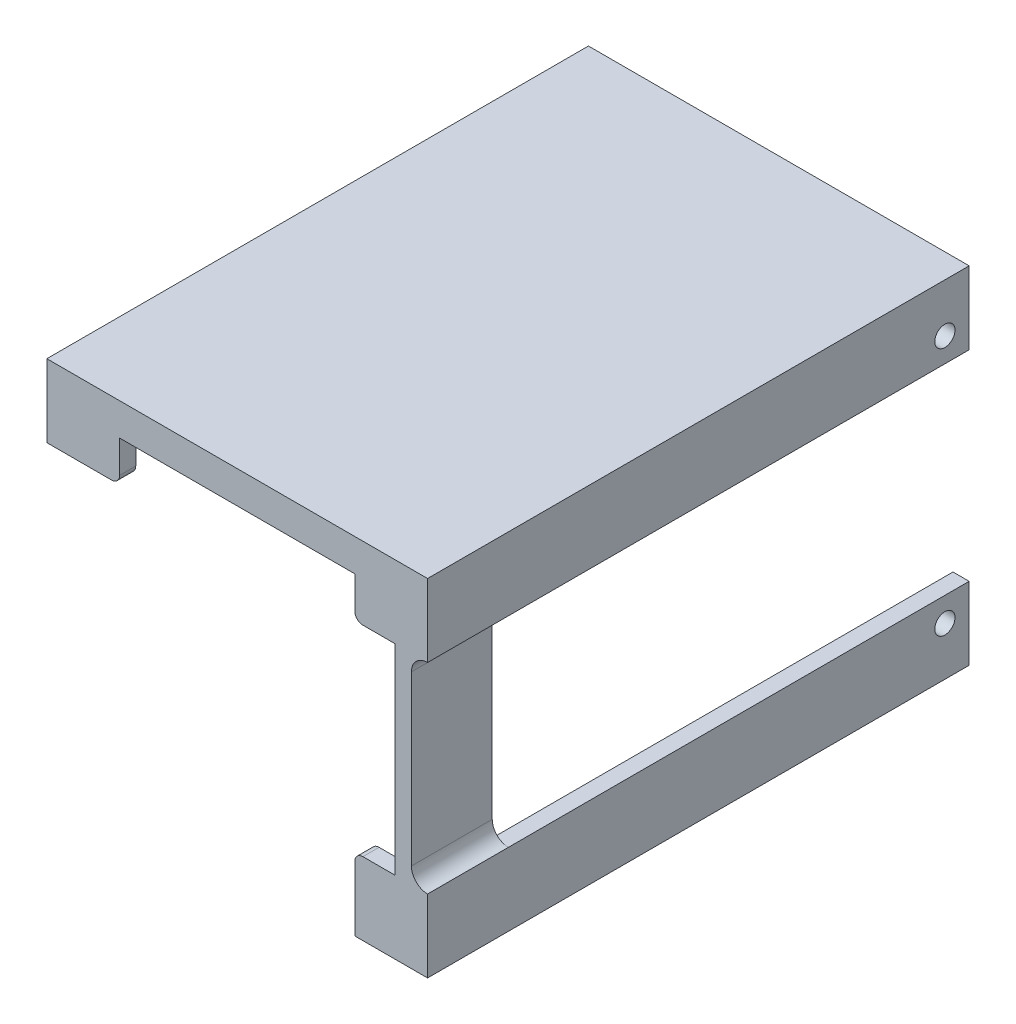
ISO-10303-21;
HEADER;
FILE_DESCRIPTION(('STEP AP214'),'2;1');
FILE_NAME('part.step','',(''),(''),'','','');
FILE_SCHEMA(('AUTOMOTIVE_DESIGN { 1 0 10303 214 1 1 1 1 }'));
ENDSEC;
DATA;
#1=APPLICATION_CONTEXT('core data for automotive mechanical design processes');
#2=APPLICATION_PROTOCOL_DEFINITION('international standard','automotive_design',2000,#1);
#3=PRODUCT_CONTEXT('',#1,'mechanical');
#4=PRODUCT('Part','Part','',(#3));
#5=PRODUCT_RELATED_PRODUCT_CATEGORY('part','',(#4));
#6=PRODUCT_DEFINITION_FORMATION('','',#4);
#7=PRODUCT_DEFINITION_CONTEXT('part definition',#1,'design');
#8=PRODUCT_DEFINITION('design','',#6,#7);
#9=PRODUCT_DEFINITION_SHAPE('','',#8);
#10=(LENGTH_UNIT() NAMED_UNIT(*) SI_UNIT(.MILLI.,.METRE.));
#11=(NAMED_UNIT(*) PLANE_ANGLE_UNIT() SI_UNIT($,.RADIAN.));
#12=(NAMED_UNIT(*) SI_UNIT($,.STERADIAN.) SOLID_ANGLE_UNIT());
#13=UNCERTAINTY_MEASURE_WITH_UNIT(LENGTH_MEASURE(1.E-05),#10,'distance_accuracy_value','');
#14=(GEOMETRIC_REPRESENTATION_CONTEXT(3) GLOBAL_UNCERTAINTY_ASSIGNED_CONTEXT((#13)) GLOBAL_UNIT_ASSIGNED_CONTEXT((#10,
#11,#12)) REPRESENTATION_CONTEXT('',''));
#15=CARTESIAN_POINT('',(0.,0.,0.));
#16=DIRECTION('',(0.,0.,1.));
#17=DIRECTION('',(1.,0.,0.));
#18=AXIS2_PLACEMENT_3D('',#15,#16,#17);
#19=CARTESIAN_POINT('',(41.1,0.,-10.));
#20=DIRECTION('',(-1.,0.,0.));
#21=DIRECTION('',(0.,-1.,0.));
#22=AXIS2_PLACEMENT_3D('',#19,#20,#21);
#23=PLANE('',#22);
#24=DIRECTION('',(0.,-1.,0.));
#25=VECTOR('',#24,1.);
#26=CARTESIAN_POINT('',(41.1,0.,0.));
#27=LINE('',#26,#25);
#28=CARTESIAN_POINT('',(41.1,-7.,0.));
#29=VERTEX_POINT('',#28);
#30=CARTESIAN_POINT('',(41.1,-27.8,0.));
#31=VERTEX_POINT('',#30);
#32=EDGE_CURVE('E429',#29,#31,#27,.T.);
#33=ORIENTED_EDGE('',*,*,#32,.T.);
#34=DIRECTION('',(0.,0.,1.));
#35=VECTOR('',#34,1.);
#36=CARTESIAN_POINT('',(41.1,-27.8,-10.));
#37=LINE('',#36,#35);
#38=CARTESIAN_POINT('',(41.1,-27.8,-10.));
#39=VERTEX_POINT('',#38);
#40=EDGE_CURVE('E484',#31,#39,#37,.F.);
#41=ORIENTED_EDGE('',*,*,#40,.T.);
#42=DIRECTION('',(0.,-1.,0.));
#43=VECTOR('',#42,1.);
#44=CARTESIAN_POINT('',(41.1,0.,-10.));
#45=LINE('',#44,#43);
#46=CARTESIAN_POINT('',(41.1,-7.,-10.));
#47=VERTEX_POINT('',#46);
#48=EDGE_CURVE('E409',#47,#39,#45,.T.);
#49=ORIENTED_EDGE('',*,*,#48,.F.);
#50=DIRECTION('',(0.,0.,1.));
#51=VECTOR('',#50,1.);
#52=CARTESIAN_POINT('',(41.1,-7.,-10.));
#53=LINE('',#52,#51);
#54=EDGE_CURVE('E481',#47,#29,#53,.T.);
#55=ORIENTED_EDGE('',*,*,#54,.T.);
#56=EDGE_LOOP('',(#33,#41,#49,#55));
#57=FACE_BOUND('',#56,.T.);
#58=ADVANCED_FACE('F35',(#57),#23,.F.);
#59=CARTESIAN_POINT('',(39.1,-34.8,-10.));
#60=DIRECTION('',(0.,1.,0.));
#61=DIRECTION('',(-1.,0.,0.));
#62=AXIS2_PLACEMENT_3D('',#59,#60,#61);
#63=PLANE('',#62);
#64=DIRECTION('',(0.,0.,1.));
#65=VECTOR('',#64,1.);
#66=CARTESIAN_POINT('',(34.1,-34.8,-10.));
#67=LINE('',#66,#65);
#68=CARTESIAN_POINT('',(34.1,-34.8,-10.));
#69=VERTEX_POINT('',#68);
#70=CARTESIAN_POINT('',(34.1,-34.8,-2.));
#71=VERTEX_POINT('',#70);
#72=EDGE_CURVE('E427',#69,#71,#67,.T.);
#73=ORIENTED_EDGE('',*,*,#72,.T.);
#74=DIRECTION('',(1.,0.,0.));
#75=VECTOR('',#74,1.);
#76=CARTESIAN_POINT('',(39.1,-34.8,-2.));
#77=LINE('',#76,#75);
#78=CARTESIAN_POINT('',(39.1,-34.8,-2.));
#79=VERTEX_POINT('',#78);
#80=EDGE_CURVE('E361',#71,#79,#77,.T.);
#81=ORIENTED_EDGE('',*,*,#80,.T.);
#82=DIRECTION('',(0.,0.,1.));
#83=VECTOR('',#82,1.);
#84=CARTESIAN_POINT('',(39.1,-34.8,-10.));
#85=LINE('',#84,#83);
#86=CARTESIAN_POINT('',(39.1,-34.8,-10.));
#87=VERTEX_POINT('',#86);
#88=EDGE_CURVE('E439',#87,#79,#85,.T.);
#89=ORIENTED_EDGE('',*,*,#88,.F.);
#90=DIRECTION('',(-1.,0.,0.));
#91=VECTOR('',#90,1.);
#92=CARTESIAN_POINT('',(39.1,-34.8,-10.));
#93=LINE('',#92,#91);
#94=EDGE_CURVE('E401',#87,#69,#93,.T.);
#95=ORIENTED_EDGE('',*,*,#94,.T.);
#96=EDGE_LOOP('',(#73,#81,#89,#95));
#97=FACE_BOUND('',#96,.T.);
#98=ADVANCED_FACE('F553',(#97),#63,.T.);
#99=CARTESIAN_POINT('',(0.,0.,-10.));
#100=DIRECTION('',(1.,0.,0.));
#101=DIRECTION('',(0.,1.,0.));
#102=AXIS2_PLACEMENT_3D('',#99,#100,#101);
#103=PLANE('',#102);
#104=DIRECTION('',(0.,0.,1.));
#105=VECTOR('',#104,1.);
#106=CARTESIAN_POINT('',(0.,0.,-10.));
#107=LINE('',#106,#105);
#108=CARTESIAN_POINT('',(0.,0.,-10.));
#109=VERTEX_POINT('',#108);
#110=CARTESIAN_POINT('',(0.,0.,-2.));
#111=VERTEX_POINT('',#110);
#112=EDGE_CURVE('E446',#109,#111,#107,.T.);
#113=ORIENTED_EDGE('',*,*,#112,.T.);
#114=DIRECTION('',(0.,-1.,0.));
#115=VECTOR('',#114,1.);
#116=CARTESIAN_POINT('',(0.,0.,-2.));
#117=LINE('',#116,#115);
#118=CARTESIAN_POINT('',(0.,-5.,-2.));
#119=VERTEX_POINT('',#118);
#120=EDGE_CURVE('E394',#111,#119,#117,.T.);
#121=ORIENTED_EDGE('',*,*,#120,.T.);
#122=DIRECTION('',(0.,0.,1.));
#123=VECTOR('',#122,1.);
#124=CARTESIAN_POINT('',(0.,-5.,-10.));
#125=LINE('',#124,#123);
#126=CARTESIAN_POINT('',(0.,-5.,-10.));
#127=VERTEX_POINT('',#126);
#128=EDGE_CURVE('E449',#127,#119,#125,.T.);
#129=ORIENTED_EDGE('',*,*,#128,.F.);
#130=DIRECTION('',(0.,1.,0.));
#131=VECTOR('',#130,1.);
#132=CARTESIAN_POINT('',(0.,0.,-10.));
#133=LINE('',#132,#131);
#134=EDGE_CURVE('E418',#127,#109,#133,.T.);
#135=ORIENTED_EDGE('',*,*,#134,.T.);
#136=EDGE_LOOP('',(#113,#121,#129,#135));
#137=FACE_BOUND('',#136,.T.);
#138=ADVANCED_FACE('F580',(#137),#103,.T.);
#139=CARTESIAN_POINT('',(39.1,0.,-10.));
#140=DIRECTION('',(-1.,0.,0.));
#141=DIRECTION('',(0.,-1.,0.));
#142=AXIS2_PLACEMENT_3D('',#139,#140,#141);
#143=PLANE('',#142);
#144=DIRECTION('',(0.,0.,-1.));
#145=VECTOR('',#144,1.);
#146=CARTESIAN_POINT('',(39.1,-29.8,-10.));
#147=LINE('',#146,#145);
#148=CARTESIAN_POINT('',(39.1,-29.8,0.));
#149=VERTEX_POINT('',#148);
#150=CARTESIAN_POINT('',(39.1,-29.8,-2.));
#151=VERTEX_POINT('',#150);
#152=EDGE_CURVE('E354',#149,#151,#147,.T.);
#153=ORIENTED_EDGE('',*,*,#152,.F.);
#154=DIRECTION('',(0.,-1.,0.));
#155=VECTOR('',#154,1.);
#156=CARTESIAN_POINT('',(39.1,0.,0.));
#157=LINE('',#156,#155);
#158=CARTESIAN_POINT('',(39.1,-5.,0.));
#159=VERTEX_POINT('',#158);
#160=EDGE_CURVE('E405',#159,#149,#157,.T.);
#161=ORIENTED_EDGE('',*,*,#160,.F.);
#162=DIRECTION('',(0.,0.,1.));
#163=VECTOR('',#162,1.);
#164=CARTESIAN_POINT('',(39.1,-5.,-10.));
#165=LINE('',#164,#163);
#166=CARTESIAN_POINT('',(39.1,-5.,-2.));
#167=VERTEX_POINT('',#166);
#168=EDGE_CURVE('E376',#167,#159,#165,.T.);
#169=ORIENTED_EDGE('',*,*,#168,.F.);
#170=DIRECTION('',(0.,-1.,0.));
#171=VECTOR('',#170,1.);
#172=CARTESIAN_POINT('',(39.1,0.,-2.));
#173=LINE('',#172,#171);
#174=CARTESIAN_POINT('',(39.1,0.,-2.));
#175=VERTEX_POINT('',#174);
#176=EDGE_CURVE('E381',#175,#167,#173,.T.);
#177=ORIENTED_EDGE('',*,*,#176,.F.);
#178=DIRECTION('',(0.,0.,1.));
#179=VECTOR('',#178,1.);
#180=CARTESIAN_POINT('',(39.1,0.,-10.));
#181=LINE('',#180,#179);
#182=CARTESIAN_POINT('',(39.1,0.,-10.));
#183=VERTEX_POINT('',#182);
#184=EDGE_CURVE('E443',#183,#175,#181,.T.);
#185=ORIENTED_EDGE('',*,*,#184,.F.);
#186=DIRECTION('',(0.,-1.,0.));
#187=VECTOR('',#186,1.);
#188=CARTESIAN_POINT('',(39.1,0.,-10.));
#189=LINE('',#188,#187);
#190=EDGE_CURVE('E424',#183,#87,#189,.T.);
#191=ORIENTED_EDGE('',*,*,#190,.T.);
#192=ORIENTED_EDGE('',*,*,#88,.T.);
#193=DIRECTION('',(0.,1.,0.));
#194=VECTOR('',#193,1.);
#195=CARTESIAN_POINT('',(39.1,0.,-2.));
#196=LINE('',#195,#194);
#197=EDGE_CURVE('E358',#79,#151,#196,.T.);
#198=ORIENTED_EDGE('',*,*,#197,.T.);
#199=EDGE_LOOP('',(#153,#161,#169,#177,#185,#191,#192,#198));
#200=FACE_BOUND('',#199,.T.);
#201=ADVANCED_FACE('F536',(#200),#143,.T.);
#202=CARTESIAN_POINT('',(0.,0.,-10.));
#203=DIRECTION('',(0.,-1.,0.));
#204=DIRECTION('',(0.,0.,-1.));
#205=AXIS2_PLACEMENT_3D('',#202,#203,#204);
#206=PLANE('',#205);
#207=DIRECTION('',(0.,0.,-1.));
#208=VECTOR('',#207,1.);
#209=CARTESIAN_POINT('',(34.1,0.,-10.));
#210=LINE('',#209,#208);
#211=CARTESIAN_POINT('',(34.1,0.,0.));
#212=VERTEX_POINT('',#211);
#213=CARTESIAN_POINT('',(34.1,0.,-2.));
#214=VERTEX_POINT('',#213);
#215=EDGE_CURVE('E371',#212,#214,#210,.T.);
#216=ORIENTED_EDGE('',*,*,#215,.F.);
#217=DIRECTION('',(1.,0.,0.));
#218=VECTOR('',#217,1.);
#219=CARTESIAN_POINT('',(0.,0.,0.));
#220=LINE('',#219,#218);
#221=CARTESIAN_POINT('',(5.,0.,0.));
#222=VERTEX_POINT('',#221);
#223=EDGE_CURVE('E434',#222,#212,#220,.T.);
#224=ORIENTED_EDGE('',*,*,#223,.F.);
#225=DIRECTION('',(0.,0.,1.));
#226=VECTOR('',#225,1.);
#227=CARTESIAN_POINT('',(5.,0.,-10.));
#228=LINE('',#227,#226);
#229=CARTESIAN_POINT('',(5.,0.,-2.));
#230=VERTEX_POINT('',#229);
#231=EDGE_CURVE('E390',#230,#222,#228,.T.);
#232=ORIENTED_EDGE('',*,*,#231,.F.);
#233=DIRECTION('',(-1.,0.,0.));
#234=VECTOR('',#233,1.);
#235=CARTESIAN_POINT('',(0.,0.,-2.));
#236=LINE('',#235,#234);
#237=EDGE_CURVE('E397',#230,#111,#236,.T.);
#238=ORIENTED_EDGE('',*,*,#237,.T.);
#239=ORIENTED_EDGE('',*,*,#112,.F.);
#240=DIRECTION('',(1.,0.,0.));
#241=VECTOR('',#240,1.);
#242=CARTESIAN_POINT('',(0.,0.,-10.));
#243=LINE('',#242,#241);
#244=EDGE_CURVE('E421',#109,#183,#243,.T.);
#245=ORIENTED_EDGE('',*,*,#244,.T.);
#246=ORIENTED_EDGE('',*,*,#184,.T.);
#247=DIRECTION('',(1.,0.,0.));
#248=VECTOR('',#247,1.);
#249=CARTESIAN_POINT('',(0.,0.,-2.));
#250=LINE('',#249,#248);
#251=EDGE_CURVE('E379',#214,#175,#250,.T.);
#252=ORIENTED_EDGE('',*,*,#251,.F.);
#253=EDGE_LOOP('',(#216,#224,#232,#238,#239,#245,#246,#252));
#254=FACE_BOUND('',#253,.T.);
#255=ADVANCED_FACE('F548',(#254),#206,.T.);
#256=CARTESIAN_POINT('',(0.,-5.,-10.));
#257=DIRECTION('',(0.,1.,0.));
#258=DIRECTION('',(0.,0.,1.));
#259=AXIS2_PLACEMENT_3D('',#256,#257,#258);
#260=PLANE('',#259);
#261=DIRECTION('',(1.,0.,0.));
#262=VECTOR('',#261,1.);
#263=CARTESIAN_POINT('',(-2.,-5.,-2.));
#264=LINE('',#263,#262);
#265=CARTESIAN_POINT('',(4.,-5.,-2.));
#266=VERTEX_POINT('',#265);
#267=EDGE_CURVE('E385',#119,#266,#264,.T.);
#268=ORIENTED_EDGE('',*,*,#267,.T.);
#269=DIRECTION('',(0.,0.,1.));
#270=VECTOR('',#269,1.);
#271=CARTESIAN_POINT('',(4.,-5.,0.));
#272=LINE('',#271,#270);
#273=CARTESIAN_POINT('',(4.,-5.,0.));
#274=VERTEX_POINT('',#273);
#275=EDGE_CURVE('E473',#266,#274,#272,.T.);
#276=ORIENTED_EDGE('',*,*,#275,.T.);
#277=DIRECTION('',(-1.,0.,0.));
#278=VECTOR('',#277,1.);
#279=CARTESIAN_POINT('',(0.,-5.,0.));
#280=LINE('',#279,#278);
#281=CARTESIAN_POINT('',(-4.,-5.00000000000001,0.));
#282=VERTEX_POINT('',#281);
#283=EDGE_CURVE('E432',#274,#282,#280,.T.);
#284=ORIENTED_EDGE('',*,*,#283,.T.);
#285=DIRECTION('',(0.,0.,1.));
#286=VECTOR('',#285,1.);
#287=CARTESIAN_POINT('',(-4.,-5.00000000000001,-67.));
#288=LINE('',#287,#286);
#289=CARTESIAN_POINT('',(-4.,-5.00000000000001,-67.));
#290=VERTEX_POINT('',#289);
#291=EDGE_CURVE('E316',#290,#282,#288,.T.);
#292=ORIENTED_EDGE('',*,*,#291,.F.);
#293=DIRECTION('',(-1.,0.,0.));
#294=VECTOR('',#293,1.);
#295=CARTESIAN_POINT('',(-2.,-5.00000000000001,-67.));
#296=LINE('',#295,#294);
#297=CARTESIAN_POINT('',(-2.,-5.00000000000001,-67.));
#298=VERTEX_POINT('',#297);
#299=EDGE_CURVE('E300',#298,#290,#296,.T.);
#300=ORIENTED_EDGE('',*,*,#299,.F.);
#301=DIRECTION('',(0.,0.,1.));
#302=VECTOR('',#301,1.);
#303=CARTESIAN_POINT('',(-2.,-5.00000000000001,-67.));
#304=LINE('',#303,#302);
#305=CARTESIAN_POINT('',(-2.,-5.,-10.));
#306=VERTEX_POINT('',#305);
#307=EDGE_CURVE('E313',#298,#306,#304,.T.);
#308=ORIENTED_EDGE('',*,*,#307,.T.);
#309=DIRECTION('',(-1.,0.,0.));
#310=VECTOR('',#309,1.);
#311=CARTESIAN_POINT('',(0.,-5.,-10.));
#312=LINE('',#311,#310);
#313=EDGE_CURVE('E416',#127,#306,#312,.T.);
#314=ORIENTED_EDGE('',*,*,#313,.F.);
#315=ORIENTED_EDGE('',*,*,#128,.T.);
#316=EDGE_LOOP('',(#268,#276,#284,#292,#300,#308,#314,#315));
#317=FACE_BOUND('',#316,.T.);
#318=ADVANCED_FACE('F584',(#317),#260,.F.);
#319=CARTESIAN_POINT('',(34.1,-36.8,-10.));
#320=DIRECTION('',(1.,0.,0.));
#321=DIRECTION('',(0.,0.,-1.));
#322=AXIS2_PLACEMENT_3D('',#319,#320,#321);
#323=PLANE('',#322);
#324=DIRECTION('',(0.,1.,0.));
#325=VECTOR('',#324,1.);
#326=CARTESIAN_POINT('',(34.1,-36.8,0.));
#327=LINE('',#326,#325);
#328=CARTESIAN_POINT('',(34.1,-38.8,0.));
#329=VERTEX_POINT('',#328);
#330=CARTESIAN_POINT('',(34.1,-30.8,0.));
#331=VERTEX_POINT('',#330);
#332=EDGE_CURVE('E400',#329,#331,#327,.T.);
#333=ORIENTED_EDGE('',*,*,#332,.T.);
#334=DIRECTION('',(0.,0.,1.));
#335=VECTOR('',#334,1.);
#336=CARTESIAN_POINT('',(34.1,-30.8,-2.));
#337=LINE('',#336,#335);
#338=CARTESIAN_POINT('',(34.1,-30.8,-2.));
#339=VERTEX_POINT('',#338);
#340=EDGE_CURVE('E469',#331,#339,#337,.F.);
#341=ORIENTED_EDGE('',*,*,#340,.T.);
#342=DIRECTION('',(0.,-1.,0.));
#343=VECTOR('',#342,1.);
#344=CARTESIAN_POINT('',(34.1,-36.8,-2.));
#345=LINE('',#344,#343);
#346=EDGE_CURVE('E352',#339,#71,#345,.T.);
#347=ORIENTED_EDGE('',*,*,#346,.T.);
#348=ORIENTED_EDGE('',*,*,#72,.F.);
#349=DIRECTION('',(0.,1.,0.));
#350=VECTOR('',#349,1.);
#351=CARTESIAN_POINT('',(34.1,-36.8,-10.));
#352=LINE('',#351,#350);
#353=CARTESIAN_POINT('',(34.1,-36.8,-10.));
#354=VERTEX_POINT('',#353);
#355=EDGE_CURVE('E404',#354,#69,#352,.T.);
#356=ORIENTED_EDGE('',*,*,#355,.F.);
#357=DIRECTION('',(0.,0.,1.));
#358=VECTOR('',#357,1.);
#359=CARTESIAN_POINT('',(34.1,-36.8,-67.));
#360=LINE('',#359,#358);
#361=CARTESIAN_POINT('',(34.1,-36.8,-67.));
#362=VERTEX_POINT('',#361);
#363=EDGE_CURVE('E268',#362,#354,#360,.T.);
#364=ORIENTED_EDGE('',*,*,#363,.F.);
#365=DIRECTION('',(0.,1.,0.));
#366=VECTOR('',#365,1.);
#367=CARTESIAN_POINT('',(34.1,-38.8,-67.));
#368=LINE('',#367,#366);
#369=CARTESIAN_POINT('',(34.1,-38.8,-67.));
#370=VERTEX_POINT('',#369);
#371=EDGE_CURVE('E246',#370,#362,#368,.T.);
#372=ORIENTED_EDGE('',*,*,#371,.F.);
#373=DIRECTION('',(0.,0.,1.));
#374=VECTOR('',#373,1.);
#375=CARTESIAN_POINT('',(34.1,-38.8,-67.));
#376=LINE('',#375,#374);
#377=EDGE_CURVE('E256',#370,#329,#376,.T.);
#378=ORIENTED_EDGE('',*,*,#377,.T.);
#379=EDGE_LOOP('',(#333,#341,#347,#348,#356,#364,#372,#378));
#380=FACE_BOUND('',#379,.T.);
#381=ADVANCED_FACE('F265',(#380),#323,.F.);
#382=CARTESIAN_POINT('',(0.,0.,-10.));
#383=DIRECTION('',(0.,0.,-1.));
#384=DIRECTION('',(-1.,0.,0.));
#385=AXIS2_PLACEMENT_3D('',#382,#383,#384);
#386=PLANE('',#385);
#387=ORIENTED_EDGE('',*,*,#94,.F.);
#388=ORIENTED_EDGE('',*,*,#190,.F.);
#389=ORIENTED_EDGE('',*,*,#244,.F.);
#390=ORIENTED_EDGE('',*,*,#134,.F.);
#391=ORIENTED_EDGE('',*,*,#313,.T.);
#392=DIRECTION('',(0.,1.,0.));
#393=VECTOR('',#392,1.);
#394=CARTESIAN_POINT('',(-2.,0.,-10.));
#395=LINE('',#394,#393);
#396=CARTESIAN_POINT('',(-2.,2.,-10.));
#397=VERTEX_POINT('',#396);
#398=EDGE_CURVE('E414',#306,#397,#395,.T.);
#399=ORIENTED_EDGE('',*,*,#398,.T.);
#400=DIRECTION('',(1.,0.,0.));
#401=VECTOR('',#400,1.);
#402=CARTESIAN_POINT('',(0.,2.,-10.));
#403=LINE('',#402,#401);
#404=CARTESIAN_POINT('',(41.1,2.,-10.));
#405=VERTEX_POINT('',#404);
#406=EDGE_CURVE('E412',#397,#405,#403,.T.);
#407=ORIENTED_EDGE('',*,*,#406,.T.);
#408=CARTESIAN_POINT('',(41.1,-5.,-10.));
#409=VERTEX_POINT('',#408);
#410=EDGE_CURVE('E410',#405,#409,#45,.T.);
#411=ORIENTED_EDGE('',*,*,#410,.T.);
#412=DIRECTION('',(-1.,0.,0.));
#413=VECTOR('',#412,1.);
#414=CARTESIAN_POINT('',(0.,-5.,-10.));
#415=LINE('',#414,#413);
#416=CARTESIAN_POINT('',(43.1,-5.,-10.));
#417=VERTEX_POINT('',#416);
#418=EDGE_CURVE('E56',#417,#409,#415,.T.);
#419=ORIENTED_EDGE('',*,*,#418,.F.);
#420=CARTESIAN_POINT('',(43.1,-7.,-10.));
#421=DIRECTION('',(0.,0.,-1.));
#422=DIRECTION('',(-1.,0.,0.));
#423=AXIS2_PLACEMENT_3D('',#420,#421,#422);
#424=CIRCLE('',#423,2.);
#425=EDGE_CURVE('E12',#417,#47,#424,.F.);
#426=ORIENTED_EDGE('',*,*,#425,.T.);
#427=ORIENTED_EDGE('',*,*,#48,.T.);
#428=CARTESIAN_POINT('',(43.1,-27.8,-10.));
#429=DIRECTION('',(0.,0.,-1.));
#430=DIRECTION('',(-1.,0.,0.));
#431=AXIS2_PLACEMENT_3D('',#428,#429,#430);
#432=CIRCLE('',#431,2.);
#433=CARTESIAN_POINT('',(43.1,-29.8,-10.));
#434=VERTEX_POINT('',#433);
#435=EDGE_CURVE('E489',#39,#434,#432,.F.);
#436=ORIENTED_EDGE('',*,*,#435,.T.);
#437=DIRECTION('',(1.,0.,0.));
#438=VECTOR('',#437,1.);
#439=CARTESIAN_POINT('',(41.1,-29.8,-10.));
#440=LINE('',#439,#438);
#441=CARTESIAN_POINT('',(41.1,-29.8,-10.));
#442=VERTEX_POINT('',#441);
#443=EDGE_CURVE('E50',#442,#434,#440,.T.);
#444=ORIENTED_EDGE('',*,*,#443,.F.);
#445=DIRECTION('',(0.,-1.,0.));
#446=VECTOR('',#445,1.);
#447=CARTESIAN_POINT('',(41.1,0.,-10.));
#448=LINE('',#447,#446);
#449=CARTESIAN_POINT('',(41.1,-36.8,-10.));
#450=VERTEX_POINT('',#449);
#451=EDGE_CURVE('E284',#442,#450,#448,.T.);
#452=ORIENTED_EDGE('',*,*,#451,.T.);
#453=DIRECTION('',(-1.,0.,0.));
#454=VECTOR('',#453,1.);
#455=CARTESIAN_POINT('',(39.1,-36.8,-10.));
#456=LINE('',#455,#454);
#457=EDGE_CURVE('E407',#450,#354,#456,.T.);
#458=ORIENTED_EDGE('',*,*,#457,.T.);
#459=ORIENTED_EDGE('',*,*,#355,.T.);
#460=EDGE_LOOP('',(#387,#388,#389,#390,#391,#399,#407,#411,#419,#426,#427,#436,#444,#452,#458,#459));
#461=FACE_BOUND('',#460,.T.);
#462=ADVANCED_FACE('F504',(#461),#386,.T.);
#463=CARTESIAN_POINT('',(0.,0.,0.));
#464=DIRECTION('',(0.,0.,-1.));
#465=DIRECTION('',(-1.,0.,0.));
#466=AXIS2_PLACEMENT_3D('',#463,#464,#465);
#467=PLANE('',#466);
#468=ORIENTED_EDGE('',*,*,#332,.F.);
#469=DIRECTION('',(-1.,0.,0.));
#470=VECTOR('',#469,1.);
#471=CARTESIAN_POINT('',(43.1,-38.8,0.));
#472=LINE('',#471,#470);
#473=CARTESIAN_POINT('',(43.1,-38.8,0.));
#474=VERTEX_POINT('',#473);
#475=EDGE_CURVE('E259',#474,#329,#472,.T.);
#476=ORIENTED_EDGE('',*,*,#475,.F.);
#477=DIRECTION('',(0.,-1.,0.));
#478=VECTOR('',#477,1.);
#479=CARTESIAN_POINT('',(43.1,-29.8,0.));
#480=LINE('',#479,#478);
#481=CARTESIAN_POINT('',(43.1,-29.8,0.));
#482=VERTEX_POINT('',#481);
#483=EDGE_CURVE('E269',#482,#474,#480,.T.);
#484=ORIENTED_EDGE('',*,*,#483,.F.);
#485=CARTESIAN_POINT('',(43.1,-27.8,0.));
#486=DIRECTION('',(0.,0.,-1.));
#487=DIRECTION('',(-1.,0.,0.));
#488=AXIS2_PLACEMENT_3D('',#485,#486,#487);
#489=CIRCLE('',#488,2.);
#490=EDGE_CURVE('E487',#482,#31,#489,.T.);
#491=ORIENTED_EDGE('',*,*,#490,.T.);
#492=ORIENTED_EDGE('',*,*,#32,.F.);
#493=CARTESIAN_POINT('',(43.1,-7.,0.));
#494=DIRECTION('',(0.,0.,-1.));
#495=DIRECTION('',(-1.,0.,0.));
#496=AXIS2_PLACEMENT_3D('',#493,#494,#495);
#497=CIRCLE('',#496,2.);
#498=CARTESIAN_POINT('',(43.1,-5.,0.));
#499=VERTEX_POINT('',#498);
#500=EDGE_CURVE('E43',#29,#499,#497,.T.);
#501=ORIENTED_EDGE('',*,*,#500,.T.);
#502=DIRECTION('',(0.,1.,0.));
#503=VECTOR('',#502,1.);
#504=CARTESIAN_POINT('',(43.1,-5.,0.));
#505=LINE('',#504,#503);
#506=CARTESIAN_POINT('',(43.1,4.,0.));
#507=VERTEX_POINT('',#506);
#508=EDGE_CURVE('E312',#499,#507,#505,.T.);
#509=ORIENTED_EDGE('',*,*,#508,.T.);
#510=DIRECTION('',(-1.,0.,0.));
#511=VECTOR('',#510,1.);
#512=CARTESIAN_POINT('',(43.1,4.,0.));
#513=LINE('',#512,#511);
#514=CARTESIAN_POINT('',(-4.,3.99999999999999,0.));
#515=VERTEX_POINT('',#514);
#516=EDGE_CURVE('E325',#507,#515,#513,.T.);
#517=ORIENTED_EDGE('',*,*,#516,.T.);
#518=DIRECTION('',(0.,1.,0.));
#519=VECTOR('',#518,1.);
#520=CARTESIAN_POINT('',(-4.,-5.00000000000001,0.));
#521=LINE('',#520,#519);
#522=EDGE_CURVE('E296',#282,#515,#521,.T.);
#523=ORIENTED_EDGE('',*,*,#522,.F.);
#524=ORIENTED_EDGE('',*,*,#283,.F.);
#525=CARTESIAN_POINT('',(4.,-4.,0.));
#526=DIRECTION('',(0.,0.,-1.));
#527=DIRECTION('',(-1.,0.,0.));
#528=AXIS2_PLACEMENT_3D('',#525,#526,#527);
#529=CIRCLE('',#528,1.);
#530=CARTESIAN_POINT('',(5.,-4.,0.));
#531=VERTEX_POINT('',#530);
#532=EDGE_CURVE('E456',#274,#531,#529,.F.);
#533=ORIENTED_EDGE('',*,*,#532,.T.);
#534=DIRECTION('',(0.,1.,0.));
#535=VECTOR('',#534,1.);
#536=CARTESIAN_POINT('',(5.,2.,0.));
#537=LINE('',#536,#535);
#538=EDGE_CURVE('E384',#531,#222,#537,.T.);
#539=ORIENTED_EDGE('',*,*,#538,.T.);
#540=ORIENTED_EDGE('',*,*,#223,.T.);
#541=DIRECTION('',(0.,-1.,0.));
#542=VECTOR('',#541,1.);
#543=CARTESIAN_POINT('',(34.1,2.,0.));
#544=LINE('',#543,#542);
#545=CARTESIAN_POINT('',(34.1,-4.,0.));
#546=VERTEX_POINT('',#545);
#547=EDGE_CURVE('E364',#212,#546,#544,.T.);
#548=ORIENTED_EDGE('',*,*,#547,.T.);
#549=CARTESIAN_POINT('',(35.1,-4.,0.));
#550=DIRECTION('',(0.,0.,-1.));
#551=DIRECTION('',(-1.,0.,0.));
#552=AXIS2_PLACEMENT_3D('',#549,#550,#551);
#553=CIRCLE('',#552,1.);
#554=CARTESIAN_POINT('',(35.1,-5.,0.));
#555=VERTEX_POINT('',#554);
#556=EDGE_CURVE('E460',#546,#555,#553,.F.);
#557=ORIENTED_EDGE('',*,*,#556,.T.);
#558=DIRECTION('',(1.,0.,0.));
#559=VECTOR('',#558,1.);
#560=CARTESIAN_POINT('',(41.1,-5.,0.));
#561=LINE('',#560,#559);
#562=EDGE_CURVE('E369',#555,#159,#561,.T.);
#563=ORIENTED_EDGE('',*,*,#562,.T.);
#564=ORIENTED_EDGE('',*,*,#160,.T.);
#565=DIRECTION('',(-1.,0.,0.));
#566=VECTOR('',#565,1.);
#567=CARTESIAN_POINT('',(41.1,-29.8,0.));
#568=LINE('',#567,#566);
#569=CARTESIAN_POINT('',(35.1,-29.8,0.));
#570=VERTEX_POINT('',#569);
#571=EDGE_CURVE('E339',#149,#570,#568,.T.);
#572=ORIENTED_EDGE('',*,*,#571,.T.);
#573=CARTESIAN_POINT('',(35.1,-30.8,0.));
#574=DIRECTION('',(0.,0.,-1.));
#575=DIRECTION('',(-1.,0.,0.));
#576=AXIS2_PLACEMENT_3D('',#573,#574,#575);
#577=CIRCLE('',#576,1.);
#578=EDGE_CURVE('E458',#570,#331,#577,.F.);
#579=ORIENTED_EDGE('',*,*,#578,.T.);
#580=EDGE_LOOP('',(#468,#476,#484,#491,#492,#501,#509,#517,#523,#524,#533,#539,#540,#548,#557,
#563,#564,#572,#579));
#581=FACE_BOUND('',#580,.T.);
#582=ADVANCED_FACE('F493',(#581),#467,.F.);
#583=CARTESIAN_POINT('',(5.,2.,-2.));
#584=DIRECTION('',(1.,0.,0.));
#585=DIRECTION('',(0.,0.,-1.));
#586=AXIS2_PLACEMENT_3D('',#583,#584,#585);
#587=PLANE('',#586);
#588=ORIENTED_EDGE('',*,*,#538,.F.);
#589=DIRECTION('',(0.,0.,1.));
#590=VECTOR('',#589,1.);
#591=CARTESIAN_POINT('',(5.,-4.,-2.));
#592=LINE('',#591,#590);
#593=CARTESIAN_POINT('',(5.,-4.,-2.));
#594=VERTEX_POINT('',#593);
#595=EDGE_CURVE('E476',#531,#594,#592,.F.);
#596=ORIENTED_EDGE('',*,*,#595,.T.);
#597=DIRECTION('',(0.,1.,0.));
#598=VECTOR('',#597,1.);
#599=CARTESIAN_POINT('',(5.,2.,-2.));
#600=LINE('',#599,#598);
#601=EDGE_CURVE('E388',#594,#230,#600,.T.);
#602=ORIENTED_EDGE('',*,*,#601,.T.);
#603=ORIENTED_EDGE('',*,*,#231,.T.);
#604=EDGE_LOOP('',(#588,#596,#602,#603));
#605=FACE_BOUND('',#604,.T.);
#606=ADVANCED_FACE('F673',(#605),#587,.T.);
#607=CARTESIAN_POINT('',(0.,0.,-2.));
#608=DIRECTION('',(0.,0.,1.));
#609=DIRECTION('',(1.,0.,0.));
#610=AXIS2_PLACEMENT_3D('',#607,#608,#609);
#611=PLANE('',#610);
#612=ORIENTED_EDGE('',*,*,#601,.F.);
#613=CARTESIAN_POINT('',(4.,-4.,-2.));
#614=DIRECTION('',(0.,0.,1.));
#615=DIRECTION('',(1.,0.,0.));
#616=AXIS2_PLACEMENT_3D('',#613,#614,#615);
#617=CIRCLE('',#616,1.);
#618=EDGE_CURVE('E478',#594,#266,#617,.F.);
#619=ORIENTED_EDGE('',*,*,#618,.T.);
#620=ORIENTED_EDGE('',*,*,#267,.F.);
#621=ORIENTED_EDGE('',*,*,#120,.F.);
#622=ORIENTED_EDGE('',*,*,#237,.F.);
#623=EDGE_LOOP('',(#612,#619,#620,#621,#622));
#624=FACE_BOUND('',#623,.T.);
#625=ADVANCED_FACE('F667',(#624),#611,.F.);
#626=CARTESIAN_POINT('',(41.1,-5.,-2.));
#627=DIRECTION('',(0.,-1.,0.));
#628=DIRECTION('',(1.,0.,0.));
#629=AXIS2_PLACEMENT_3D('',#626,#627,#628);
#630=PLANE('',#629);
#631=ORIENTED_EDGE('',*,*,#562,.F.);
#632=DIRECTION('',(0.,0.,1.));
#633=VECTOR('',#632,1.);
#634=CARTESIAN_POINT('',(35.1,-5.,-2.));
#635=LINE('',#634,#633);
#636=CARTESIAN_POINT('',(35.1,-5.,-2.));
#637=VERTEX_POINT('',#636);
#638=EDGE_CURVE('E462',#555,#637,#635,.F.);
#639=ORIENTED_EDGE('',*,*,#638,.T.);
#640=DIRECTION('',(1.,0.,0.));
#641=VECTOR('',#640,1.);
#642=CARTESIAN_POINT('',(41.1,-5.,-2.));
#643=LINE('',#642,#641);
#644=EDGE_CURVE('E368',#637,#167,#643,.T.);
#645=ORIENTED_EDGE('',*,*,#644,.T.);
#646=ORIENTED_EDGE('',*,*,#168,.T.);
#647=EDGE_LOOP('',(#631,#639,#645,#646));
#648=FACE_BOUND('',#647,.T.);
#649=ADVANCED_FACE('F541',(#648),#630,.T.);
#650=CARTESIAN_POINT('',(34.1,2.,-2.));
#651=DIRECTION('',(-1.,0.,0.));
#652=DIRECTION('',(0.,0.,1.));
#653=AXIS2_PLACEMENT_3D('',#650,#651,#652);
#654=PLANE('',#653);
#655=DIRECTION('',(0.,-1.,0.));
#656=VECTOR('',#655,1.);
#657=CARTESIAN_POINT('',(34.1,2.,-2.));
#658=LINE('',#657,#656);
#659=CARTESIAN_POINT('',(34.1,-4.,-2.));
#660=VERTEX_POINT('',#659);
#661=EDGE_CURVE('E365',#214,#660,#658,.T.);
#662=ORIENTED_EDGE('',*,*,#661,.T.);
#663=DIRECTION('',(0.,0.,1.));
#664=VECTOR('',#663,1.);
#665=CARTESIAN_POINT('',(34.1,-4.,-2.));
#666=LINE('',#665,#664);
#667=EDGE_CURVE('E442',#660,#546,#666,.T.);
#668=ORIENTED_EDGE('',*,*,#667,.T.);
#669=ORIENTED_EDGE('',*,*,#547,.F.);
#670=ORIENTED_EDGE('',*,*,#215,.T.);
#671=EDGE_LOOP('',(#662,#668,#669,#670));
#672=FACE_BOUND('',#671,.T.);
#673=ADVANCED_FACE('F664',(#672),#654,.T.);
#674=CARTESIAN_POINT('',(0.,0.,-2.));
#675=DIRECTION('',(0.,0.,-1.));
#676=DIRECTION('',(-1.,0.,0.));
#677=AXIS2_PLACEMENT_3D('',#674,#675,#676);
#678=PLANE('',#677);
#679=ORIENTED_EDGE('',*,*,#644,.F.);
#680=CARTESIAN_POINT('',(35.1,-4.,-2.));
#681=DIRECTION('',(0.,0.,-1.));
#682=DIRECTION('',(-1.,0.,0.));
#683=AXIS2_PLACEMENT_3D('',#680,#681,#682);
#684=CIRCLE('',#683,1.);
#685=EDGE_CURVE('E464',#637,#660,#684,.T.);
#686=ORIENTED_EDGE('',*,*,#685,.T.);
#687=ORIENTED_EDGE('',*,*,#661,.F.);
#688=ORIENTED_EDGE('',*,*,#251,.T.);
#689=ORIENTED_EDGE('',*,*,#176,.T.);
#690=EDGE_LOOP('',(#679,#686,#687,#688,#689));
#691=FACE_BOUND('',#690,.T.);
#692=ADVANCED_FACE('F661',(#691),#678,.T.);
#693=CARTESIAN_POINT('',(41.1,-29.8,-2.));
#694=DIRECTION('',(0.,1.,0.));
#695=DIRECTION('',(0.,0.,1.));
#696=AXIS2_PLACEMENT_3D('',#693,#694,#695);
#697=PLANE('',#696);
#698=DIRECTION('',(-1.,0.,0.));
#699=VECTOR('',#698,1.);
#700=CARTESIAN_POINT('',(41.1,-29.8,-2.));
#701=LINE('',#700,#699);
#702=CARTESIAN_POINT('',(35.1,-29.8,-2.));
#703=VERTEX_POINT('',#702);
#704=EDGE_CURVE('E349',#151,#703,#701,.T.);
#705=ORIENTED_EDGE('',*,*,#704,.T.);
#706=DIRECTION('',(0.,0.,1.));
#707=VECTOR('',#706,1.);
#708=CARTESIAN_POINT('',(35.1,-29.8,0.));
#709=LINE('',#708,#707);
#710=EDGE_CURVE('E466',#703,#570,#709,.T.);
#711=ORIENTED_EDGE('',*,*,#710,.T.);
#712=ORIENTED_EDGE('',*,*,#571,.F.);
#713=ORIENTED_EDGE('',*,*,#152,.T.);
#714=EDGE_LOOP('',(#705,#711,#712,#713));
#715=FACE_BOUND('',#714,.T.);
#716=ADVANCED_FACE('F532',(#715),#697,.T.);
#717=CARTESIAN_POINT('',(0.,0.,-2.));
#718=DIRECTION('',(0.,0.,1.));
#719=DIRECTION('',(1.,0.,0.));
#720=AXIS2_PLACEMENT_3D('',#717,#718,#719);
#721=PLANE('',#720);
#722=ORIENTED_EDGE('',*,*,#346,.F.);
#723=CARTESIAN_POINT('',(35.1,-30.8,-2.));
#724=DIRECTION('',(0.,0.,1.));
#725=DIRECTION('',(1.,0.,0.));
#726=AXIS2_PLACEMENT_3D('',#723,#724,#725);
#727=CIRCLE('',#726,1.);
#728=EDGE_CURVE('E471',#339,#703,#727,.F.);
#729=ORIENTED_EDGE('',*,*,#728,.T.);
#730=ORIENTED_EDGE('',*,*,#704,.F.);
#731=ORIENTED_EDGE('',*,*,#197,.F.);
#732=ORIENTED_EDGE('',*,*,#80,.F.);
#733=EDGE_LOOP('',(#722,#729,#730,#731,#732));
#734=FACE_BOUND('',#733,.T.);
#735=ADVANCED_FACE('F529',(#734),#721,.F.);
#736=CARTESIAN_POINT('',(35.1,-4.,-2.));
#737=DIRECTION('',(0.,0.,1.));
#738=DIRECTION('',(1.,0.,0.));
#739=AXIS2_PLACEMENT_3D('',#736,#737,#738);
#740=CYLINDRICAL_SURFACE('',#739,1.);
#741=ORIENTED_EDGE('',*,*,#685,.F.);
#742=ORIENTED_EDGE('',*,*,#638,.F.);
#743=ORIENTED_EDGE('',*,*,#556,.F.);
#744=ORIENTED_EDGE('',*,*,#667,.F.);
#745=EDGE_LOOP('',(#741,#742,#743,#744));
#746=FACE_BOUND('',#745,.T.);
#747=ADVANCED_FACE('F588',(#746),#740,.T.);
#748=CARTESIAN_POINT('',(35.1,-30.8,-2.));
#749=DIRECTION('',(0.,0.,-1.));
#750=DIRECTION('',(-1.,0.,0.));
#751=AXIS2_PLACEMENT_3D('',#748,#749,#750);
#752=CYLINDRICAL_SURFACE('',#751,1.);
#753=ORIENTED_EDGE('',*,*,#728,.F.);
#754=ORIENTED_EDGE('',*,*,#340,.F.);
#755=ORIENTED_EDGE('',*,*,#578,.F.);
#756=ORIENTED_EDGE('',*,*,#710,.F.);
#757=EDGE_LOOP('',(#753,#754,#755,#756));
#758=FACE_BOUND('',#757,.T.);
#759=ADVANCED_FACE('F525',(#758),#752,.T.);
#760=CARTESIAN_POINT('',(4.,-4.,-10.));
#761=DIRECTION('',(0.,0.,-1.));
#762=DIRECTION('',(-1.,0.,0.));
#763=AXIS2_PLACEMENT_3D('',#760,#761,#762);
#764=CYLINDRICAL_SURFACE('',#763,1.);
#765=ORIENTED_EDGE('',*,*,#618,.F.);
#766=ORIENTED_EDGE('',*,*,#595,.F.);
#767=ORIENTED_EDGE('',*,*,#532,.F.);
#768=ORIENTED_EDGE('',*,*,#275,.F.);
#769=EDGE_LOOP('',(#765,#766,#767,#768));
#770=FACE_BOUND('',#769,.T.);
#771=ADVANCED_FACE('F594',(#770),#764,.T.);
#772=CARTESIAN_POINT('',(43.1,4.,-67.));
#773=DIRECTION('',(0.,1.,0.));
#774=DIRECTION('',(-1.,0.,0.));
#775=AXIS2_PLACEMENT_3D('',#772,#773,#774);
#776=PLANE('',#775);
#777=DIRECTION('',(-1.,0.,0.));
#778=VECTOR('',#777,1.);
#779=CARTESIAN_POINT('',(43.1,4.,-67.));
#780=LINE('',#779,#778);
#781=CARTESIAN_POINT('',(43.1,4.,-67.));
#782=VERTEX_POINT('',#781);
#783=CARTESIAN_POINT('',(-4.,3.99999999999999,-67.));
#784=VERTEX_POINT('',#783);
#785=EDGE_CURVE('E331',#782,#784,#780,.T.);
#786=ORIENTED_EDGE('',*,*,#785,.T.);
#787=DIRECTION('',(0.,0.,1.));
#788=VECTOR('',#787,1.);
#789=CARTESIAN_POINT('',(-4.,3.99999999999999,-67.));
#790=LINE('',#789,#788);
#791=EDGE_CURVE('E306',#784,#515,#790,.T.);
#792=ORIENTED_EDGE('',*,*,#791,.T.);
#793=ORIENTED_EDGE('',*,*,#516,.F.);
#794=DIRECTION('',(0.,0.,1.));
#795=VECTOR('',#794,1.);
#796=CARTESIAN_POINT('',(43.1,4.,-67.));
#797=LINE('',#796,#795);
#798=EDGE_CURVE('E337',#782,#507,#797,.T.);
#799=ORIENTED_EDGE('',*,*,#798,.F.);
#800=EDGE_LOOP('',(#786,#792,#793,#799));
#801=FACE_BOUND('',#800,.T.);
#802=ADVANCED_FACE('F596',(#801),#776,.T.);
#803=CARTESIAN_POINT('',(43.1,-5.,-67.));
#804=DIRECTION('',(1.,0.,0.));
#805=DIRECTION('',(0.,0.,-1.));
#806=AXIS2_PLACEMENT_3D('',#803,#804,#805);
#807=PLANE('',#806);
#808=CARTESIAN_POINT('',(43.1,-2.,-64.));
#809=DIRECTION('',(1.,0.,0.));
#810=DIRECTION('',(0.,0.,-1.));
#811=AXIS2_PLACEMENT_3D('',#808,#809,#810);
#812=CIRCLE('',#811,1.25);
#813=CARTESIAN_POINT('',(43.1,-2.,-65.25));
#814=VERTEX_POINT('',#813);
#815=EDGE_CURVE('E982',#814,#814,#812,.T.);
#816=ORIENTED_EDGE('',*,*,#815,.F.);
#817=EDGE_LOOP('',(#816));
#818=FACE_BOUND('',#817,.T.);
#819=ORIENTED_EDGE('',*,*,#508,.F.);
#820=DIRECTION('',(0.,0.,1.));
#821=VECTOR('',#820,1.);
#822=CARTESIAN_POINT('',(43.1,-5.,-67.));
#823=LINE('',#822,#821);
#824=EDGE_CURVE('E343',#417,#499,#823,.T.);
#825=ORIENTED_EDGE('',*,*,#824,.F.);
#826=CARTESIAN_POINT('',(43.1,-5.,-67.));
#827=VERTEX_POINT('',#826);
#828=EDGE_CURVE('E340',#827,#417,#823,.T.);
#829=ORIENTED_EDGE('',*,*,#828,.F.);
#830=DIRECTION('',(0.,1.,0.));
#831=VECTOR('',#830,1.);
#832=CARTESIAN_POINT('',(43.1,-5.,-67.));
#833=LINE('',#832,#831);
#834=EDGE_CURVE('E328',#827,#782,#833,.T.);
#835=ORIENTED_EDGE('',*,*,#834,.T.);
#836=ORIENTED_EDGE('',*,*,#798,.T.);
#837=EDGE_LOOP('',(#819,#825,#829,#835,#836));
#838=FACE_BOUND('',#837,.T.);
#839=ADVANCED_FACE('F499',(#818,#838),#807,.T.);
#840=CARTESIAN_POINT('',(41.1,-5.,-67.));
#841=DIRECTION('',(0.,-1.,0.));
#842=DIRECTION('',(0.,0.,-1.));
#843=AXIS2_PLACEMENT_3D('',#840,#841,#842);
#844=PLANE('',#843);
#845=ORIENTED_EDGE('',*,*,#828,.T.);
#846=ORIENTED_EDGE('',*,*,#418,.T.);
#847=DIRECTION('',(0.,0.,1.));
#848=VECTOR('',#847,1.);
#849=CARTESIAN_POINT('',(41.1,-5.,-67.));
#850=LINE('',#849,#848);
#851=CARTESIAN_POINT('',(41.1,-5.,-67.));
#852=VERTEX_POINT('',#851);
#853=EDGE_CURVE('E344',#852,#409,#850,.T.);
#854=ORIENTED_EDGE('',*,*,#853,.F.);
#855=DIRECTION('',(1.,0.,0.));
#856=VECTOR('',#855,1.);
#857=CARTESIAN_POINT('',(41.1,-5.,-67.));
#858=LINE('',#857,#856);
#859=EDGE_CURVE('E324',#852,#827,#858,.T.);
#860=ORIENTED_EDGE('',*,*,#859,.T.);
#861=EDGE_LOOP('',(#845,#846,#854,#860));
#862=FACE_BOUND('',#861,.T.);
#863=ADVANCED_FACE('F645',(#862),#844,.T.);
#864=CARTESIAN_POINT('',(41.1,2.,-67.));
#865=DIRECTION('',(-1.,0.,0.));
#866=DIRECTION('',(0.,0.,1.));
#867=AXIS2_PLACEMENT_3D('',#864,#865,#866);
#868=PLANE('',#867);
#869=CARTESIAN_POINT('',(41.1,-2.,-64.));
#870=DIRECTION('',(-1.,0.,0.));
#871=DIRECTION('',(0.,0.,1.));
#872=AXIS2_PLACEMENT_3D('',#869,#870,#871);
#873=CIRCLE('',#872,1.25);
#874=CARTESIAN_POINT('',(41.1,-2.,-62.75));
#875=VERTEX_POINT('',#874);
#876=EDGE_CURVE('E273',#875,#875,#873,.T.);
#877=ORIENTED_EDGE('',*,*,#876,.F.);
#878=EDGE_LOOP('',(#877));
#879=FACE_BOUND('',#878,.T.);
#880=ORIENTED_EDGE('',*,*,#853,.T.);
#881=ORIENTED_EDGE('',*,*,#410,.F.);
#882=DIRECTION('',(0.,0.,1.));
#883=VECTOR('',#882,1.);
#884=CARTESIAN_POINT('',(41.1,2.,-67.));
#885=LINE('',#884,#883);
#886=CARTESIAN_POINT('',(41.1,2.,-67.));
#887=VERTEX_POINT('',#886);
#888=EDGE_CURVE('E333',#887,#405,#885,.T.);
#889=ORIENTED_EDGE('',*,*,#888,.F.);
#890=DIRECTION('',(0.,-1.,0.));
#891=VECTOR('',#890,1.);
#892=CARTESIAN_POINT('',(41.1,2.,-67.));
#893=LINE('',#892,#891);
#894=EDGE_CURVE('E321',#887,#852,#893,.T.);
#895=ORIENTED_EDGE('',*,*,#894,.T.);
#896=EDGE_LOOP('',(#880,#881,#889,#895));
#897=FACE_BOUND('',#896,.T.);
#898=ADVANCED_FACE('F649',(#879,#897),#868,.T.);
#899=CARTESIAN_POINT('',(34.1,2.,-67.));
#900=DIRECTION('',(0.,-1.,0.));
#901=DIRECTION('',(0.,0.,-1.));
#902=AXIS2_PLACEMENT_3D('',#899,#900,#901);
#903=PLANE('',#902);
#904=ORIENTED_EDGE('',*,*,#888,.T.);
#905=ORIENTED_EDGE('',*,*,#406,.F.);
#906=DIRECTION('',(0.,0.,1.));
#907=VECTOR('',#906,1.);
#908=CARTESIAN_POINT('',(-2.,1.99999999999999,-67.));
#909=LINE('',#908,#907);
#910=CARTESIAN_POINT('',(-2.,1.99999999999999,-67.));
#911=VERTEX_POINT('',#910);
#912=EDGE_CURVE('E309',#911,#397,#909,.T.);
#913=ORIENTED_EDGE('',*,*,#912,.F.);
#914=DIRECTION('',(-1.,0.,0.));
#915=VECTOR('',#914,1.);
#916=CARTESIAN_POINT('',(5.,2.,-67.));
#917=LINE('',#916,#915);
#918=EDGE_CURVE('E304',#887,#911,#917,.T.);
#919=ORIENTED_EDGE('',*,*,#918,.F.);
#920=EDGE_LOOP('',(#904,#905,#913,#919));
#921=FACE_BOUND('',#920,.T.);
#922=ADVANCED_FACE('F638',(#921),#903,.T.);
#923=CARTESIAN_POINT('',(0.,0.,-67.));
#924=DIRECTION('',(0.,0.,1.));
#925=DIRECTION('',(1.,0.,0.));
#926=AXIS2_PLACEMENT_3D('',#923,#924,#925);
#927=PLANE('',#926);
#928=ORIENTED_EDGE('',*,*,#894,.F.);
#929=ORIENTED_EDGE('',*,*,#918,.T.);
#930=DIRECTION('',(0.,-1.,0.));
#931=VECTOR('',#930,1.);
#932=CARTESIAN_POINT('',(-2.,1.99999999999999,-67.));
#933=LINE('',#932,#931);
#934=EDGE_CURVE('E302',#911,#298,#933,.T.);
#935=ORIENTED_EDGE('',*,*,#934,.T.);
#936=ORIENTED_EDGE('',*,*,#299,.T.);
#937=DIRECTION('',(0.,1.,0.));
#938=VECTOR('',#937,1.);
#939=CARTESIAN_POINT('',(-4.,-5.00000000000001,-67.));
#940=LINE('',#939,#938);
#941=EDGE_CURVE('E297',#290,#784,#940,.T.);
#942=ORIENTED_EDGE('',*,*,#941,.T.);
#943=ORIENTED_EDGE('',*,*,#785,.F.);
#944=ORIENTED_EDGE('',*,*,#834,.F.);
#945=ORIENTED_EDGE('',*,*,#859,.F.);
#946=EDGE_LOOP('',(#928,#929,#935,#936,#942,#943,#944,#945));
#947=FACE_BOUND('',#946,.T.);
#948=ADVANCED_FACE('F631',(#947),#927,.F.);
#949=CARTESIAN_POINT('',(-2.,1.99999999999999,-67.));
#950=DIRECTION('',(-1.,0.,0.));
#951=DIRECTION('',(0.,-1.,0.));
#952=AXIS2_PLACEMENT_3D('',#949,#950,#951);
#953=PLANE('',#952);
#954=CARTESIAN_POINT('',(-2.,-2.,-64.));
#955=DIRECTION('',(-1.,0.,0.));
#956=DIRECTION('',(0.,-1.,0.));
#957=AXIS2_PLACEMENT_3D('',#954,#955,#956);
#958=CIRCLE('',#957,1.25);
#959=CARTESIAN_POINT('',(-2.,-3.25,-64.));
#960=VERTEX_POINT('',#959);
#961=EDGE_CURVE('E977',#960,#960,#958,.T.);
#962=ORIENTED_EDGE('',*,*,#961,.T.);
#963=EDGE_LOOP('',(#962));
#964=FACE_BOUND('',#963,.T.);
#965=ORIENTED_EDGE('',*,*,#398,.F.);
#966=ORIENTED_EDGE('',*,*,#307,.F.);
#967=ORIENTED_EDGE('',*,*,#934,.F.);
#968=ORIENTED_EDGE('',*,*,#912,.T.);
#969=EDGE_LOOP('',(#965,#966,#967,#968));
#970=FACE_BOUND('',#969,.T.);
#971=ADVANCED_FACE('F628',(#964,#970),#953,.F.);
#972=CARTESIAN_POINT('',(-4.,-5.00000000000001,-67.));
#973=DIRECTION('',(1.,0.,0.));
#974=DIRECTION('',(0.,1.,0.));
#975=AXIS2_PLACEMENT_3D('',#972,#973,#974);
#976=PLANE('',#975);
#977=CARTESIAN_POINT('',(-4.,-2.,-64.));
#978=DIRECTION('',(1.,0.,0.));
#979=DIRECTION('',(0.,0.,-1.));
#980=AXIS2_PLACEMENT_3D('',#977,#978,#979);
#981=CIRCLE('',#980,1.25);
#982=CARTESIAN_POINT('',(-4.,-2.,-65.25));
#983=VERTEX_POINT('',#982);
#984=EDGE_CURVE('E979',#983,#983,#981,.T.);
#985=ORIENTED_EDGE('',*,*,#984,.T.);
#986=EDGE_LOOP('',(#985));
#987=FACE_BOUND('',#986,.T.);
#988=ORIENTED_EDGE('',*,*,#522,.T.);
#989=ORIENTED_EDGE('',*,*,#791,.F.);
#990=ORIENTED_EDGE('',*,*,#941,.F.);
#991=ORIENTED_EDGE('',*,*,#291,.T.);
#992=EDGE_LOOP('',(#988,#989,#990,#991));
#993=FACE_BOUND('',#992,.T.);
#994=ADVANCED_FACE('F570',(#987,#993),#976,.F.);
#995=CARTESIAN_POINT('',(34.1,-36.8,-67.));
#996=DIRECTION('',(0.,-1.,0.));
#997=DIRECTION('',(1.,0.,0.));
#998=AXIS2_PLACEMENT_3D('',#995,#996,#997);
#999=PLANE('',#998);
#1000=ORIENTED_EDGE('',*,*,#457,.F.);
#1001=DIRECTION('',(0.,0.,1.));
#1002=VECTOR('',#1001,1.);
#1003=CARTESIAN_POINT('',(41.1,-36.8,-67.));
#1004=LINE('',#1003,#1002);
#1005=CARTESIAN_POINT('',(41.1,-36.8,-67.));
#1006=VERTEX_POINT('',#1005);
#1007=EDGE_CURVE('E285',#1006,#450,#1004,.T.);
#1008=ORIENTED_EDGE('',*,*,#1007,.F.);
#1009=DIRECTION('',(1.,0.,0.));
#1010=VECTOR('',#1009,1.);
#1011=CARTESIAN_POINT('',(34.1,-36.8,-67.));
#1012=LINE('',#1011,#1010);
#1013=EDGE_CURVE('E263',#362,#1006,#1012,.T.);
#1014=ORIENTED_EDGE('',*,*,#1013,.F.);
#1015=ORIENTED_EDGE('',*,*,#363,.T.);
#1016=EDGE_LOOP('',(#1000,#1008,#1014,#1015));
#1017=FACE_BOUND('',#1016,.T.);
#1018=ADVANCED_FACE('F557',(#1017),#999,.F.);
#1019=CARTESIAN_POINT('',(41.1,-36.8,-67.));
#1020=DIRECTION('',(1.,0.,0.));
#1021=DIRECTION('',(0.,1.,0.));
#1022=AXIS2_PLACEMENT_3D('',#1019,#1020,#1021);
#1023=PLANE('',#1022);
#1024=CARTESIAN_POINT('',(41.1,-32.8,-64.));
#1025=DIRECTION('',(1.,0.,0.));
#1026=DIRECTION('',(0.,1.,0.));
#1027=AXIS2_PLACEMENT_3D('',#1024,#1025,#1026);
#1028=CIRCLE('',#1027,1.25);
#1029=CARTESIAN_POINT('',(41.1,-31.55,-64.));
#1030=VERTEX_POINT('',#1029);
#1031=EDGE_CURVE('E986',#1030,#1030,#1028,.F.);
#1032=ORIENTED_EDGE('',*,*,#1031,.F.);
#1033=EDGE_LOOP('',(#1032));
#1034=FACE_BOUND('',#1033,.T.);
#1035=ORIENTED_EDGE('',*,*,#451,.F.);
#1036=DIRECTION('',(0.,0.,1.));
#1037=VECTOR('',#1036,1.);
#1038=CARTESIAN_POINT('',(41.1,-29.8,-67.));
#1039=LINE('',#1038,#1037);
#1040=CARTESIAN_POINT('',(41.1,-29.8,-67.));
#1041=VERTEX_POINT('',#1040);
#1042=EDGE_CURVE('E288',#1041,#442,#1039,.T.);
#1043=ORIENTED_EDGE('',*,*,#1042,.F.);
#1044=DIRECTION('',(0.,1.,0.));
#1045=VECTOR('',#1044,1.);
#1046=CARTESIAN_POINT('',(41.1,-36.8,-67.));
#1047=LINE('',#1046,#1045);
#1048=EDGE_CURVE('E279',#1006,#1041,#1047,.T.);
#1049=ORIENTED_EDGE('',*,*,#1048,.F.);
#1050=ORIENTED_EDGE('',*,*,#1007,.T.);
#1051=EDGE_LOOP('',(#1035,#1043,#1049,#1050));
#1052=FACE_BOUND('',#1051,.T.);
#1053=ADVANCED_FACE('F561',(#1034,#1052),#1023,.F.);
#1054=CARTESIAN_POINT('',(41.1,-29.8,-67.));
#1055=DIRECTION('',(0.,-1.,0.));
#1056=DIRECTION('',(1.,0.,0.));
#1057=AXIS2_PLACEMENT_3D('',#1054,#1055,#1056);
#1058=PLANE('',#1057);
#1059=ORIENTED_EDGE('',*,*,#1042,.T.);
#1060=ORIENTED_EDGE('',*,*,#443,.T.);
#1061=DIRECTION('',(0.,0.,1.));
#1062=VECTOR('',#1061,1.);
#1063=CARTESIAN_POINT('',(43.1,-29.8,-67.));
#1064=LINE('',#1063,#1062);
#1065=CARTESIAN_POINT('',(43.1,-29.8,-67.));
#1066=VERTEX_POINT('',#1065);
#1067=EDGE_CURVE('E290',#1066,#434,#1064,.T.);
#1068=ORIENTED_EDGE('',*,*,#1067,.F.);
#1069=DIRECTION('',(1.,0.,0.));
#1070=VECTOR('',#1069,1.);
#1071=CARTESIAN_POINT('',(41.1,-29.8,-67.));
#1072=LINE('',#1071,#1070);
#1073=EDGE_CURVE('E277',#1041,#1066,#1072,.T.);
#1074=ORIENTED_EDGE('',*,*,#1073,.F.);
#1075=EDGE_LOOP('',(#1059,#1060,#1068,#1074));
#1076=FACE_BOUND('',#1075,.T.);
#1077=ADVANCED_FACE('F514',(#1076),#1058,.F.);
#1078=CARTESIAN_POINT('',(43.1,-29.8,-67.));
#1079=DIRECTION('',(-1.,0.,0.));
#1080=DIRECTION('',(0.,-1.,0.));
#1081=AXIS2_PLACEMENT_3D('',#1078,#1079,#1080);
#1082=PLANE('',#1081);
#1083=CARTESIAN_POINT('',(43.1,-32.8,-64.));
#1084=DIRECTION('',(-1.,0.,0.));
#1085=DIRECTION('',(0.,0.,-1.));
#1086=AXIS2_PLACEMENT_3D('',#1083,#1084,#1085);
#1087=CIRCLE('',#1086,1.25);
#1088=CARTESIAN_POINT('',(43.1,-32.8,-65.25));
#1089=VERTEX_POINT('',#1088);
#1090=EDGE_CURVE('E990',#1089,#1089,#1087,.T.);
#1091=ORIENTED_EDGE('',*,*,#1090,.T.);
#1092=EDGE_LOOP('',(#1091));
#1093=FACE_BOUND('',#1092,.T.);
#1094=ORIENTED_EDGE('',*,*,#483,.T.);
#1095=DIRECTION('',(0.,0.,1.));
#1096=VECTOR('',#1095,1.);
#1097=CARTESIAN_POINT('',(43.1,-38.8,-67.));
#1098=LINE('',#1097,#1096);
#1099=CARTESIAN_POINT('',(43.1,-38.8,-67.));
#1100=VERTEX_POINT('',#1099);
#1101=EDGE_CURVE('E262',#1100,#474,#1098,.T.);
#1102=ORIENTED_EDGE('',*,*,#1101,.F.);
#1103=DIRECTION('',(0.,-1.,0.));
#1104=VECTOR('',#1103,1.);
#1105=CARTESIAN_POINT('',(43.1,-29.8,-67.));
#1106=LINE('',#1105,#1104);
#1107=EDGE_CURVE('E249',#1066,#1100,#1106,.T.);
#1108=ORIENTED_EDGE('',*,*,#1107,.F.);
#1109=ORIENTED_EDGE('',*,*,#1067,.T.);
#1110=EDGE_CURVE('E293',#434,#482,#1064,.T.);
#1111=ORIENTED_EDGE('',*,*,#1110,.T.);
#1112=EDGE_LOOP('',(#1094,#1102,#1108,#1109,#1111));
#1113=FACE_BOUND('',#1112,.T.);
#1114=ADVANCED_FACE('F519',(#1093,#1113),#1082,.F.);
#1115=CARTESIAN_POINT('',(43.1,-38.8,-67.));
#1116=DIRECTION('',(0.,1.,0.));
#1117=DIRECTION('',(-1.,0.,0.));
#1118=AXIS2_PLACEMENT_3D('',#1115,#1116,#1117);
#1119=PLANE('',#1118);
#1120=ORIENTED_EDGE('',*,*,#475,.T.);
#1121=ORIENTED_EDGE('',*,*,#377,.F.);
#1122=DIRECTION('',(-1.,0.,0.));
#1123=VECTOR('',#1122,1.);
#1124=CARTESIAN_POINT('',(43.1,-38.8,-67.));
#1125=LINE('',#1124,#1123);
#1126=EDGE_CURVE('E242',#1100,#370,#1125,.T.);
#1127=ORIENTED_EDGE('',*,*,#1126,.F.);
#1128=ORIENTED_EDGE('',*,*,#1101,.T.);
#1129=EDGE_LOOP('',(#1120,#1121,#1127,#1128));
#1130=FACE_BOUND('',#1129,.T.);
#1131=ADVANCED_FACE('F257',(#1130),#1119,.F.);
#1132=CARTESIAN_POINT('',(0.,-34.8,-67.));
#1133=DIRECTION('',(0.,0.,1.));
#1134=DIRECTION('',(1.,0.,0.));
#1135=AXIS2_PLACEMENT_3D('',#1132,#1133,#1134);
#1136=PLANE('',#1135);
#1137=ORIENTED_EDGE('',*,*,#371,.T.);
#1138=ORIENTED_EDGE('',*,*,#1013,.T.);
#1139=ORIENTED_EDGE('',*,*,#1048,.T.);
#1140=ORIENTED_EDGE('',*,*,#1073,.T.);
#1141=ORIENTED_EDGE('',*,*,#1107,.T.);
#1142=ORIENTED_EDGE('',*,*,#1126,.T.);
#1143=EDGE_LOOP('',(#1137,#1138,#1139,#1140,#1141,#1142));
#1144=FACE_BOUND('',#1143,.T.);
#1145=ADVANCED_FACE('F244',(#1144),#1136,.F.);
#1146=CARTESIAN_POINT('',(-4.,-2.,-64.));
#1147=DIRECTION('',(1.,0.,0.));
#1148=DIRECTION('',(0.,0.,-1.));
#1149=AXIS2_PLACEMENT_3D('',#1146,#1147,#1148);
#1150=CYLINDRICAL_SURFACE('',#1149,1.25);
#1151=ORIENTED_EDGE('',*,*,#984,.F.);
#1152=EDGE_LOOP('',(#1151));
#1153=FACE_BOUND('',#1152,.T.);
#1154=ORIENTED_EDGE('',*,*,#961,.F.);
#1155=EDGE_LOOP('',(#1154));
#1156=FACE_BOUND('',#1155,.T.);
#1157=ADVANCED_FACE('F609',(#1153,#1156),#1150,.F.);
#1158=ORIENTED_EDGE('',*,*,#876,.T.);
#1159=EDGE_LOOP('',(#1158));
#1160=FACE_BOUND('',#1159,.T.);
#1161=ORIENTED_EDGE('',*,*,#815,.T.);
#1162=EDGE_LOOP('',(#1161));
#1163=FACE_BOUND('',#1162,.T.);
#1164=ADVANCED_FACE('F604',(#1160,#1163),#1150,.F.);
#1165=CARTESIAN_POINT('',(-4.00000000000005,-32.8,-64.));
#1166=DIRECTION('',(1.,0.,0.));
#1167=DIRECTION('',(0.,1.,0.));
#1168=AXIS2_PLACEMENT_3D('',#1165,#1166,#1167);
#1169=CYLINDRICAL_SURFACE('',#1168,1.25);
#1170=ORIENTED_EDGE('',*,*,#1090,.F.);
#1171=EDGE_LOOP('',(#1170));
#1172=FACE_BOUND('',#1171,.T.);
#1173=ORIENTED_EDGE('',*,*,#1031,.T.);
#1174=EDGE_LOOP('',(#1173));
#1175=FACE_BOUND('',#1174,.T.);
#1176=ADVANCED_FACE('F599',(#1172,#1175),#1169,.F.);
#1177=CARTESIAN_POINT('',(43.1,-27.8,-67.));
#1178=DIRECTION('',(0.,0.,-1.));
#1179=DIRECTION('',(-1.,0.,0.));
#1180=AXIS2_PLACEMENT_3D('',#1177,#1178,#1179);
#1181=CYLINDRICAL_SURFACE('',#1180,2.);
#1182=ORIENTED_EDGE('',*,*,#435,.F.);
#1183=ORIENTED_EDGE('',*,*,#40,.F.);
#1184=ORIENTED_EDGE('',*,*,#490,.F.);
#1185=ORIENTED_EDGE('',*,*,#1110,.F.);
#1186=EDGE_LOOP('',(#1182,#1183,#1184,#1185));
#1187=FACE_BOUND('',#1186,.T.);
#1188=ADVANCED_FACE('F509',(#1187),#1181,.F.);
#1189=CARTESIAN_POINT('',(43.1,-7.,-10.));
#1190=DIRECTION('',(0.,0.,1.));
#1191=DIRECTION('',(1.,0.,0.));
#1192=AXIS2_PLACEMENT_3D('',#1189,#1190,#1191);
#1193=CYLINDRICAL_SURFACE('',#1192,2.);
#1194=ORIENTED_EDGE('',*,*,#425,.F.);
#1195=ORIENTED_EDGE('',*,*,#824,.T.);
#1196=ORIENTED_EDGE('',*,*,#500,.F.);
#1197=ORIENTED_EDGE('',*,*,#54,.F.);
#1198=EDGE_LOOP('',(#1194,#1195,#1196,#1197));
#1199=FACE_BOUND('',#1198,.T.);
#1200=ADVANCED_FACE('F37',(#1199),#1193,.F.);
#1201=CLOSED_SHELL('',(#58,#98,#138,#201,#255,#318,#381,#462,#582,#606,#625,#649,#673,#692,#716,
#735,#747,#759,#771,#802,#839,#863,#898,#922,#948,#971,#994,#1018,#1053,#1077,#1114,#1131,#1145,
#1157,#1164,#1176,#1188,#1200));
#1202=MANIFOLD_SOLID_BREP('B2',#1201);
#1203=ADVANCED_BREP_SHAPE_REPRESENTATION('',(#18,#1202),#14);
#1204=SHAPE_DEFINITION_REPRESENTATION(#9,#1203);
ENDSEC;
END-ISO-10303-21;
